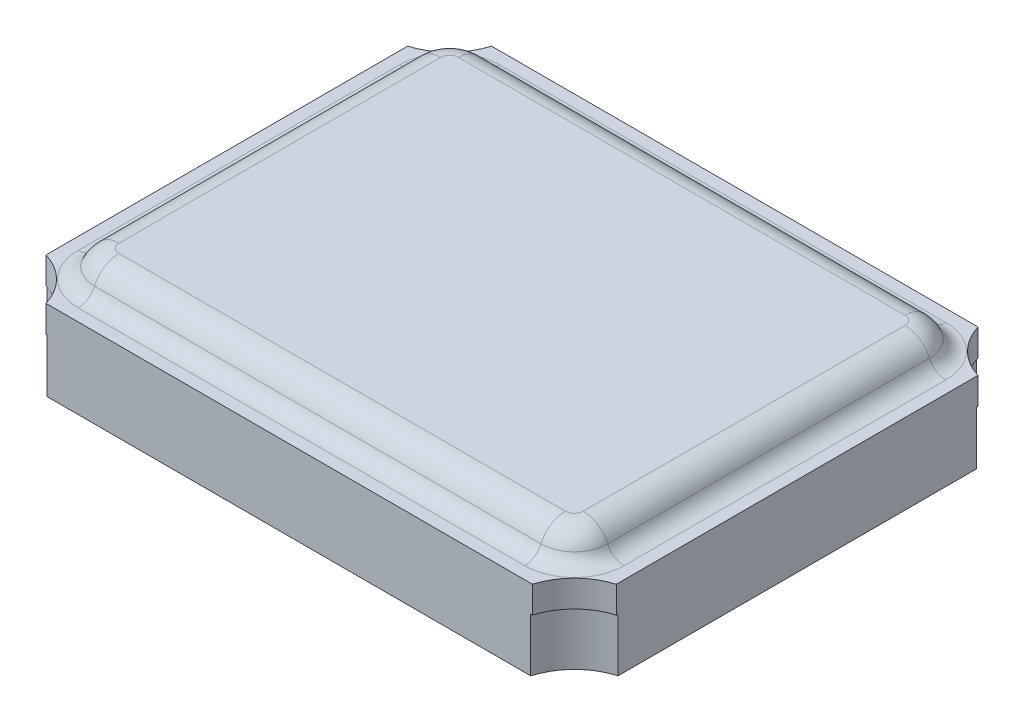
ISO-10303-21;
HEADER;
FILE_DESCRIPTION(('STEP AP214'),'2;1');
FILE_NAME('part.step','',(''),(''),'','','');
FILE_SCHEMA(('AUTOMOTIVE_DESIGN { 1 0 10303 214 1 1 1 1 }'));
ENDSEC;
DATA;
#1=APPLICATION_CONTEXT('core data for automotive mechanical design processes');
#2=APPLICATION_PROTOCOL_DEFINITION('international standard','automotive_design',2000,#1);
#3=PRODUCT_CONTEXT('',#1,'mechanical');
#4=PRODUCT('Part','Part','',(#3));
#5=PRODUCT_RELATED_PRODUCT_CATEGORY('part','',(#4));
#6=PRODUCT_DEFINITION_FORMATION('','',#4);
#7=PRODUCT_DEFINITION_CONTEXT('part definition',#1,'design');
#8=PRODUCT_DEFINITION('design','',#6,#7);
#9=PRODUCT_DEFINITION_SHAPE('','',#8);
#10=(LENGTH_UNIT() NAMED_UNIT(*) SI_UNIT(.MILLI.,.METRE.));
#11=(NAMED_UNIT(*) PLANE_ANGLE_UNIT() SI_UNIT($,.RADIAN.));
#12=(NAMED_UNIT(*) SI_UNIT($,.STERADIAN.) SOLID_ANGLE_UNIT());
#13=UNCERTAINTY_MEASURE_WITH_UNIT(LENGTH_MEASURE(1.E-05),#10,'distance_accuracy_value','');
#14=(GEOMETRIC_REPRESENTATION_CONTEXT(3) GLOBAL_UNCERTAINTY_ASSIGNED_CONTEXT((#13)) GLOBAL_UNIT_ASSIGNED_CONTEXT((#10,
#11,#12)) REPRESENTATION_CONTEXT('',''));
#15=CARTESIAN_POINT('',(0.,0.,0.));
#16=DIRECTION('',(0.,0.,1.));
#17=DIRECTION('',(1.,0.,0.));
#18=AXIS2_PLACEMENT_3D('',#15,#16,#17);
#19=CARTESIAN_POINT('',(1.59999998773912,0.6,1.24999999556222));
#20=DIRECTION('',(0.,1.,0.));
#21=DIRECTION('',(0.,0.,1.));
#22=AXIS2_PLACEMENT_3D('',#19,#20,#21);
#23=PLANE('',#22);
#24=DIRECTION('',(0.,0.,1.));
#25=VECTOR('',#24,1.);
#26=CARTESIAN_POINT('',(0.297487396266169,0.6,0.798743698800394));
#27=LINE('',#26,#25);
#28=CARTESIAN_POINT('',(0.297487396266175,0.600000000000001,2.1525125890859));
#29=VERTEX_POINT('',#28);
#30=CARTESIAN_POINT('',(0.297487396266174,0.599999999999997,0.347487402038613));
#31=VERTEX_POINT('',#30);
#32=EDGE_CURVE('E487',#29,#31,#27,.F.);
#33=ORIENTED_EDGE('',*,*,#32,.F.);
#34=CARTESIAN_POINT('',(0.347487396266163,0.600000000000001,2.15251258908591));
#35=DIRECTION('',(0.,1.,0.));
#36=DIRECTION('',(0.,0.,1.));
#37=AXIS2_PLACEMENT_3D('',#34,#35,#36);
#38=CIRCLE('',#37,0.0499999999999691);
#39=CARTESIAN_POINT('',(0.347487396266167,0.599999999999999,2.20251258908588));
#40=VERTEX_POINT('',#39);
#41=EDGE_CURVE('E20',#29,#40,#38,.T.);
#42=ORIENTED_EDGE('',*,*,#41,.T.);
#43=DIRECTION('',(1.,0.,0.));
#44=VECTOR('',#43,1.);
#45=CARTESIAN_POINT('',(0.973743692002642,0.6,2.20251258908588));
#46=LINE('',#45,#44);
#47=CARTESIAN_POINT('',(2.85251257921206,0.6,2.20251258908588));
#48=VERTEX_POINT('',#47);
#49=EDGE_CURVE('E426',#48,#40,#46,.F.);
#50=ORIENTED_EDGE('',*,*,#49,.F.);
#51=CARTESIAN_POINT('',(2.85251257921206,0.599999999999999,2.15251258908587));
#52=DIRECTION('',(0.,1.,0.));
#53=DIRECTION('',(0.,0.,1.));
#54=AXIS2_PLACEMENT_3D('',#51,#52,#53);
#55=CIRCLE('',#54,0.0499999999999989);
#56=CARTESIAN_POINT('',(2.90251257921206,0.599999999999999,2.15251258908587));
#57=VERTEX_POINT('',#56);
#58=EDGE_CURVE('E449',#48,#57,#55,.T.);
#59=ORIENTED_EDGE('',*,*,#58,.T.);
#60=DIRECTION('',(0.,0.,-1.));
#61=VECTOR('',#60,1.);
#62=CARTESIAN_POINT('',(2.90251257921206,0.6,1.70125629232405));
#63=LINE('',#62,#61);
#64=CARTESIAN_POINT('',(2.90251257921206,0.599999999999998,0.347487402038569));
#65=VERTEX_POINT('',#64);
#66=EDGE_CURVE('E459',#65,#57,#63,.F.);
#67=ORIENTED_EDGE('',*,*,#66,.F.);
#68=CARTESIAN_POINT('',(2.85251257921206,0.599999999999998,0.347487402038573));
#69=DIRECTION('',(0.,1.,0.));
#70=DIRECTION('',(0.,0.,1.));
#71=AXIS2_PLACEMENT_3D('',#68,#69,#70);
#72=CIRCLE('',#71,0.0500000000000093);
#73=CARTESIAN_POINT('',(2.85251257921206,0.6,0.297487402038566));
#74=VERTEX_POINT('',#73);
#75=EDGE_CURVE('E469',#65,#74,#72,.T.);
#76=ORIENTED_EDGE('',*,*,#75,.T.);
#77=DIRECTION('',(-1.,0.,0.));
#78=VECTOR('',#77,1.);
#79=CARTESIAN_POINT('',(2.22625628347559,0.6,0.297487402038565));
#80=LINE('',#79,#78);
#81=CARTESIAN_POINT('',(0.347487396266196,0.599999999999998,0.297487402038572));
#82=VERTEX_POINT('',#81);
#83=EDGE_CURVE('E478',#82,#74,#80,.F.);
#84=ORIENTED_EDGE('',*,*,#83,.F.);
#85=CARTESIAN_POINT('',(0.347487396266224,0.599999999999989,0.347487402038624));
#86=DIRECTION('',(1.70601822522482E-13,1.,1.86794537880544E-13));
#87=DIRECTION('',(0.,-1.86794537880544E-13,1.));
#88=AXIS2_PLACEMENT_3D('',#85,#86,#87);
#89=CIRCLE('',#88,0.0500000000000564);
#90=EDGE_CURVE('E483',#82,#31,#89,.T.);
#91=ORIENTED_EDGE('',*,*,#90,.T.);
#92=EDGE_LOOP('',(#33,#42,#50,#59,#67,#76,#84,#91));
#93=FACE_BOUND('',#92,.T.);
#94=ADVANCED_FACE('F16',(#93),#23,.T.);
#95=CARTESIAN_POINT('',(0.297487396266168,0.45,0.798743698800394));
#96=DIRECTION('',(0.,0.,1.));
#97=DIRECTION('',(1.,0.,0.));
#98=AXIS2_PLACEMENT_3D('',#95,#96,#97);
#99=CYLINDRICAL_SURFACE('',#98,0.15);
#100=ORIENTED_EDGE('',*,*,#32,.T.);
#101=CARTESIAN_POINT('',(0.297487396266165,0.449999999999997,0.347487402038575));
#102=DIRECTION('',(0.,-1.8913304564466E-13,1.));
#103=DIRECTION('',(0.,-1.,-1.8913304564466E-13));
#104=AXIS2_PLACEMENT_3D('',#101,#102,#103);
#105=CIRCLE('',#104,0.15);
#106=CARTESIAN_POINT('',(0.160010125417491,0.509999999999996,0.34748740203857));
#107=VERTEX_POINT('',#106);
#108=EDGE_CURVE('E479',#31,#107,#105,.T.);
#109=ORIENTED_EDGE('',*,*,#108,.T.);
#110=DIRECTION('',(0.,0.,-1.));
#111=VECTOR('',#110,1.);
#112=CARTESIAN_POINT('',(0.160010125417493,0.51,0.798743698800394));
#113=LINE('',#112,#111);
#114=CARTESIAN_POINT('',(0.160010125417493,0.51,2.15251258908588));
#115=VERTEX_POINT('',#114);
#116=EDGE_CURVE('E166',#107,#115,#113,.F.);
#117=ORIENTED_EDGE('',*,*,#116,.T.);
#118=CARTESIAN_POINT('',(0.297487396266169,0.45,2.15251258908589));
#119=DIRECTION('',(0.,0.,-1.));
#120=DIRECTION('',(0.,1.,0.));
#121=AXIS2_PLACEMENT_3D('',#118,#119,#120);
#122=CIRCLE('',#121,0.150000000000001);
#123=EDGE_CURVE('E423',#115,#29,#122,.T.);
#124=ORIENTED_EDGE('',*,*,#123,.T.);
#125=EDGE_LOOP('',(#100,#109,#117,#124));
#126=FACE_BOUND('',#125,.T.);
#127=ADVANCED_FACE('F831',(#126),#99,.T.);
#128=CARTESIAN_POINT('',(0.347487396266199,0.449999999999988,0.347487402038596));
#129=DIRECTION('',(1.70601822522482E-13,1.,1.86794537880544E-13));
#130=DIRECTION('',(0.,-1.86794537880544E-13,1.));
#131=AXIS2_PLACEMENT_3D('',#128,#129,#130);
#132=DEGENERATE_TOROIDAL_SURFACE('',#131,0.0500000000000337,0.150000000000001,.T.);
#133=ORIENTED_EDGE('',*,*,#108,.F.);
#134=ORIENTED_EDGE('',*,*,#90,.F.);
#135=CARTESIAN_POINT('',(0.347487396266168,0.45,0.297487402038564));
#136=DIRECTION('',(-1.,0.,0.));
#137=DIRECTION('',(0.,0.,1.));
#138=AXIS2_PLACEMENT_3D('',#135,#136,#137);
#139=CIRCLE('',#138,0.15);
#140=CARTESIAN_POINT('',(0.347487396266168,0.51,0.160010131189889));
#141=VERTEX_POINT('',#140);
#142=EDGE_CURVE('E475',#141,#82,#139,.F.);
#143=ORIENTED_EDGE('',*,*,#142,.F.);
#144=CARTESIAN_POINT('',(0.347487396266168,0.51,0.347487402038565));
#145=DIRECTION('',(0.,-1.,0.));
#146=DIRECTION('',(0.,0.,-1.));
#147=AXIS2_PLACEMENT_3D('',#144,#145,#146);
#148=CIRCLE('',#147,0.187477270848675);
#149=EDGE_CURVE('E174',#141,#107,#148,.F.);
#150=ORIENTED_EDGE('',*,*,#149,.T.);
#151=EDGE_LOOP('',(#133,#134,#143,#150));
#152=FACE_BOUND('',#151,.T.);
#153=ADVANCED_FACE('F535',(#152),#132,.T.);
#154=CARTESIAN_POINT('',(2.22625628347559,0.45,0.297487402038564));
#155=DIRECTION('',(-1.,0.,0.));
#156=DIRECTION('',(0.,0.,1.));
#157=AXIS2_PLACEMENT_3D('',#154,#155,#156);
#158=CYLINDRICAL_SURFACE('',#157,0.15);
#159=ORIENTED_EDGE('',*,*,#83,.T.);
#160=CARTESIAN_POINT('',(2.85251257921206,0.449999999999997,0.297487402038567));
#161=DIRECTION('',(-1.,0.,0.));
#162=DIRECTION('',(0.,-1.,0.));
#163=AXIS2_PLACEMENT_3D('',#160,#161,#162);
#164=CIRCLE('',#163,0.150000000000004);
#165=CARTESIAN_POINT('',(2.85251257921206,0.509999999999999,0.160010131189889));
#166=VERTEX_POINT('',#165);
#167=EDGE_CURVE('E460',#74,#166,#164,.T.);
#168=ORIENTED_EDGE('',*,*,#167,.T.);
#169=DIRECTION('',(1.,0.,0.));
#170=VECTOR('',#169,1.);
#171=CARTESIAN_POINT('',(2.22625628347559,0.51,0.160010131189889));
#172=LINE('',#171,#170);
#173=EDGE_CURVE('E390',#166,#141,#172,.F.);
#174=ORIENTED_EDGE('',*,*,#173,.T.);
#175=ORIENTED_EDGE('',*,*,#142,.T.);
#176=EDGE_LOOP('',(#159,#168,#174,#175));
#177=FACE_BOUND('',#176,.T.);
#178=ADVANCED_FACE('F538',(#177),#158,.T.);
#179=CARTESIAN_POINT('',(2.85251257921206,0.449999999999996,0.347487402038568));
#180=DIRECTION('',(0.,1.,0.));
#181=DIRECTION('',(0.,0.,1.));
#182=AXIS2_PLACEMENT_3D('',#179,#180,#181);
#183=DEGENERATE_TOROIDAL_SURFACE('',#182,0.0500000000000045,0.150000000000002,.T.);
#184=ORIENTED_EDGE('',*,*,#167,.F.);
#185=ORIENTED_EDGE('',*,*,#75,.F.);
#186=CARTESIAN_POINT('',(2.90251257921206,0.45,0.347487402038565));
#187=DIRECTION('',(0.,0.,-1.));
#188=DIRECTION('',(-1.,0.,0.));
#189=AXIS2_PLACEMENT_3D('',#186,#187,#188);
#190=CIRCLE('',#189,0.15);
#191=CARTESIAN_POINT('',(3.03998985006074,0.51,0.347487402038565));
#192=VERTEX_POINT('',#191);
#193=EDGE_CURVE('E456',#192,#65,#190,.F.);
#194=ORIENTED_EDGE('',*,*,#193,.F.);
#195=CARTESIAN_POINT('',(2.85251257921206,0.509999999999999,0.347487402038565));
#196=DIRECTION('',(0.,-1.,0.));
#197=DIRECTION('',(0.,0.,-1.));
#198=AXIS2_PLACEMENT_3D('',#195,#196,#197);
#199=CIRCLE('',#198,0.187477270848677);
#200=EDGE_CURVE('E385',#192,#166,#199,.F.);
#201=ORIENTED_EDGE('',*,*,#200,.T.);
#202=EDGE_LOOP('',(#184,#185,#194,#201));
#203=FACE_BOUND('',#202,.T.);
#204=ADVANCED_FACE('F611',(#203),#183,.T.);
#205=CARTESIAN_POINT('',(2.90251257921206,0.45,1.70125629232405));
#206=DIRECTION('',(0.,0.,-1.));
#207=DIRECTION('',(-1.,0.,0.));
#208=AXIS2_PLACEMENT_3D('',#205,#206,#207);
#209=CYLINDRICAL_SURFACE('',#208,0.15);
#210=ORIENTED_EDGE('',*,*,#66,.T.);
#211=CARTESIAN_POINT('',(2.90251257921206,0.449999999999998,2.15251258908587));
#212=DIRECTION('',(0.,0.,-1.));
#213=DIRECTION('',(-1.,0.,0.));
#214=AXIS2_PLACEMENT_3D('',#211,#212,#213);
#215=CIRCLE('',#214,0.150000000000001);
#216=CARTESIAN_POINT('',(3.03998985006074,0.509999999999998,2.15251258908588));
#217=VERTEX_POINT('',#216);
#218=EDGE_CURVE('E440',#57,#217,#215,.T.);
#219=ORIENTED_EDGE('',*,*,#218,.T.);
#220=DIRECTION('',(0.,0.,1.));
#221=VECTOR('',#220,1.);
#222=CARTESIAN_POINT('',(3.03998985006074,0.510000000000001,1.70125629232405));
#223=LINE('',#222,#221);
#224=EDGE_CURVE('E360',#217,#192,#223,.F.);
#225=ORIENTED_EDGE('',*,*,#224,.T.);
#226=ORIENTED_EDGE('',*,*,#193,.T.);
#227=EDGE_LOOP('',(#210,#219,#225,#226));
#228=FACE_BOUND('',#227,.T.);
#229=ADVANCED_FACE('F609',(#228),#209,.T.);
#230=CARTESIAN_POINT('',(2.85251257921206,0.45,2.15251258908587));
#231=DIRECTION('',(0.,1.,0.));
#232=DIRECTION('',(0.,0.,1.));
#233=AXIS2_PLACEMENT_3D('',#230,#231,#232);
#234=DEGENERATE_TOROIDAL_SURFACE('',#233,0.0500000000000153,0.149999999999999,.T.);
#235=ORIENTED_EDGE('',*,*,#218,.F.);
#236=ORIENTED_EDGE('',*,*,#58,.F.);
#237=CARTESIAN_POINT('',(2.85251257921206,0.45,2.20251258908588));
#238=DIRECTION('',(1.,0.,0.));
#239=DIRECTION('',(0.,0.,-1.));
#240=AXIS2_PLACEMENT_3D('',#237,#238,#239);
#241=CIRCLE('',#240,0.15);
#242=CARTESIAN_POINT('',(2.85251257921206,0.51,2.33998985993456));
#243=VERTEX_POINT('',#242);
#244=EDGE_CURVE('E437',#243,#48,#241,.F.);
#245=ORIENTED_EDGE('',*,*,#244,.F.);
#246=CARTESIAN_POINT('',(2.85251257921206,0.509999999999998,2.15251258908588));
#247=DIRECTION('',(0.,-1.,0.));
#248=DIRECTION('',(0.,0.,-1.));
#249=AXIS2_PLACEMENT_3D('',#246,#247,#248);
#250=CIRCLE('',#249,0.187477270848676);
#251=EDGE_CURVE('E354',#243,#217,#250,.F.);
#252=ORIENTED_EDGE('',*,*,#251,.T.);
#253=EDGE_LOOP('',(#235,#236,#245,#252));
#254=FACE_BOUND('',#253,.T.);
#255=ADVANCED_FACE('F604',(#254),#234,.T.);
#256=CARTESIAN_POINT('',(0.973743692002642,0.45,2.20251258908588));
#257=DIRECTION('',(1.,0.,0.));
#258=DIRECTION('',(0.,0.,-1.));
#259=AXIS2_PLACEMENT_3D('',#256,#257,#258);
#260=CYLINDRICAL_SURFACE('',#259,0.15);
#261=ORIENTED_EDGE('',*,*,#49,.T.);
#262=CARTESIAN_POINT('',(0.347487396266174,0.449999999999994,2.20251258908589));
#263=DIRECTION('',(1.,0.,0.));
#264=DIRECTION('',(0.,1.,0.));
#265=AXIS2_PLACEMENT_3D('',#262,#263,#264);
#266=CIRCLE('',#265,0.150000000000006);
#267=CARTESIAN_POINT('',(0.347487396266169,0.509999999999998,2.33998985993456));
#268=VERTEX_POINT('',#267);
#269=EDGE_CURVE('E413',#40,#268,#266,.T.);
#270=ORIENTED_EDGE('',*,*,#269,.T.);
#271=DIRECTION('',(-1.,0.,0.));
#272=VECTOR('',#271,1.);
#273=CARTESIAN_POINT('',(0.973743692002642,0.510000000000001,2.33998985993456));
#274=LINE('',#273,#272);
#275=EDGE_CURVE('E329',#268,#243,#274,.F.);
#276=ORIENTED_EDGE('',*,*,#275,.T.);
#277=ORIENTED_EDGE('',*,*,#244,.T.);
#278=EDGE_LOOP('',(#261,#270,#276,#277));
#279=FACE_BOUND('',#278,.T.);
#280=ADVANCED_FACE('F606',(#279),#260,.T.);
#281=CARTESIAN_POINT('',(0.347487396266163,0.45,2.1525125890859));
#282=DIRECTION('',(0.,1.,0.));
#283=DIRECTION('',(0.,0.,1.));
#284=AXIS2_PLACEMENT_3D('',#281,#282,#283);
#285=DEGENERATE_TOROIDAL_SURFACE('',#284,0.0499999999999942,0.150000000000001,.T.);
#286=ORIENTED_EDGE('',*,*,#269,.F.);
#287=ORIENTED_EDGE('',*,*,#41,.F.);
#288=ORIENTED_EDGE('',*,*,#123,.F.);
#289=CARTESIAN_POINT('',(0.347487396266168,0.51,2.15251258908588));
#290=DIRECTION('',(0.,-1.,0.));
#291=DIRECTION('',(0.,0.,-1.));
#292=AXIS2_PLACEMENT_3D('',#289,#290,#291);
#293=CIRCLE('',#292,0.187477270848675);
#294=EDGE_CURVE('E225',#115,#268,#293,.F.);
#295=ORIENTED_EDGE('',*,*,#294,.T.);
#296=EDGE_LOOP('',(#286,#287,#288,#295));
#297=FACE_BOUND('',#296,.T.);
#298=ADVANCED_FACE('F18',(#297),#285,.T.);
#299=CARTESIAN_POINT('',(0.0683586115183765,0.55,0.798743698800394));
#300=DIRECTION('',(0.,0.,-1.));
#301=DIRECTION('',(-1.,0.,0.));
#302=AXIS2_PLACEMENT_3D('',#299,#300,#301);
#303=CYLINDRICAL_SURFACE('',#302,0.1);
#304=ORIENTED_EDGE('',*,*,#116,.F.);
#305=CARTESIAN_POINT('',(0.0683586115183759,0.55,0.347487402038565));
#306=DIRECTION('',(0.,0.,-1.));
#307=DIRECTION('',(-1.,0.,0.));
#308=AXIS2_PLACEMENT_3D('',#305,#306,#307);
#309=CIRCLE('',#308,0.1);
#310=CARTESIAN_POINT('',(0.0683586115183763,0.45,0.347487402038565));
#311=VERTEX_POINT('',#310);
#312=EDGE_CURVE('E242',#107,#311,#309,.T.);
#313=ORIENTED_EDGE('',*,*,#312,.T.);
#314=DIRECTION('',(0.,0.,1.));
#315=VECTOR('',#314,1.);
#316=CARTESIAN_POINT('',(0.0683586115183766,0.45,1.25));
#317=LINE('',#316,#315);
#318=CARTESIAN_POINT('',(0.0683586115183743,0.45,2.15251258908588));
#319=VERTEX_POINT('',#318);
#320=EDGE_CURVE('E234',#319,#311,#317,.F.);
#321=ORIENTED_EDGE('',*,*,#320,.F.);
#322=CARTESIAN_POINT('',(0.068358611518376,0.55,2.15251258908588));
#323=DIRECTION('',(0.,0.,-1.));
#324=DIRECTION('',(-1.,0.,0.));
#325=AXIS2_PLACEMENT_3D('',#322,#323,#324);
#326=CIRCLE('',#325,0.1);
#327=EDGE_CURVE('E218',#319,#115,#326,.F.);
#328=ORIENTED_EDGE('',*,*,#327,.T.);
#329=EDGE_LOOP('',(#304,#313,#321,#328));
#330=FACE_BOUND('',#329,.T.);
#331=ADVANCED_FACE('F241',(#330),#303,.F.);
#332=CARTESIAN_POINT('',(0.347487396266168,0.55,0.347487402038565));
#333=DIRECTION('',(0.,-1.,0.));
#334=DIRECTION('',(0.,0.,-1.));
#335=AXIS2_PLACEMENT_3D('',#332,#333,#334);
#336=TOROIDAL_SURFACE('',#335,0.279128784747792,0.1);
#337=CARTESIAN_POINT('',(0.347487396266168,0.45,0.347487402038565));
#338=DIRECTION('',(0.,1.,0.));
#339=DIRECTION('',(0.,0.,-1.));
#340=AXIS2_PLACEMENT_3D('',#337,#338,#339);
#341=CIRCLE('',#340,0.279128784747792);
#342=CARTESIAN_POINT('',(0.347487396266168,0.45,0.0683586172907728));
#343=VERTEX_POINT('',#342);
#344=EDGE_CURVE('E244',#311,#343,#341,.F.);
#345=ORIENTED_EDGE('',*,*,#344,.F.);
#346=ORIENTED_EDGE('',*,*,#312,.F.);
#347=ORIENTED_EDGE('',*,*,#149,.F.);
#348=CARTESIAN_POINT('',(0.347487396266168,0.55,0.0683586172907727));
#349=DIRECTION('',(1.,0.,0.));
#350=DIRECTION('',(0.,0.,-1.));
#351=AXIS2_PLACEMENT_3D('',#348,#349,#350);
#352=CIRCLE('',#351,0.1);
#353=EDGE_CURVE('E388',#141,#343,#352,.T.);
#354=ORIENTED_EDGE('',*,*,#353,.T.);
#355=EDGE_LOOP('',(#345,#346,#347,#354));
#356=FACE_BOUND('',#355,.T.);
#357=ADVANCED_FACE('F396',(#356),#336,.F.);
#358=CARTESIAN_POINT('',(2.22625628347559,0.55,0.0683586172907723));
#359=DIRECTION('',(1.,0.,0.));
#360=DIRECTION('',(0.,0.,-1.));
#361=AXIS2_PLACEMENT_3D('',#358,#359,#360);
#362=CYLINDRICAL_SURFACE('',#361,0.1);
#363=DIRECTION('',(1.,0.,0.));
#364=VECTOR('',#363,1.);
#365=CARTESIAN_POINT('',(1.6,0.45,0.0683586172907727));
#366=LINE('',#365,#364);
#367=CARTESIAN_POINT('',(2.85251257921206,0.45,0.068358617290772));
#368=VERTEX_POINT('',#367);
#369=EDGE_CURVE('E247',#343,#368,#366,.T.);
#370=ORIENTED_EDGE('',*,*,#369,.F.);
#371=ORIENTED_EDGE('',*,*,#353,.F.);
#372=ORIENTED_EDGE('',*,*,#173,.F.);
#373=CARTESIAN_POINT('',(2.85251257921206,0.55,0.068358617290772));
#374=DIRECTION('',(1.,0.,0.));
#375=DIRECTION('',(0.,0.,-1.));
#376=AXIS2_PLACEMENT_3D('',#373,#374,#375);
#377=CIRCLE('',#376,0.1);
#378=EDGE_CURVE('E377',#166,#368,#377,.T.);
#379=ORIENTED_EDGE('',*,*,#378,.T.);
#380=EDGE_LOOP('',(#370,#371,#372,#379));
#381=FACE_BOUND('',#380,.T.);
#382=ADVANCED_FACE('F371',(#381),#362,.F.);
#383=CARTESIAN_POINT('',(2.85251257921206,0.55,0.347487402038565));
#384=DIRECTION('',(0.,-1.,0.));
#385=DIRECTION('',(0.,0.,-1.));
#386=AXIS2_PLACEMENT_3D('',#383,#384,#385);
#387=TOROIDAL_SURFACE('',#386,0.279128784747793,0.1);
#388=CARTESIAN_POINT('',(2.85251257921206,0.45,0.347487402038565));
#389=DIRECTION('',(0.,1.,0.));
#390=DIRECTION('',(1.,0.,0.));
#391=AXIS2_PLACEMENT_3D('',#388,#389,#390);
#392=CIRCLE('',#391,0.279128784747793);
#393=CARTESIAN_POINT('',(3.13164136395986,0.45,0.347487402038565));
#394=VERTEX_POINT('',#393);
#395=EDGE_CURVE('E597',#368,#394,#392,.F.);
#396=ORIENTED_EDGE('',*,*,#395,.F.);
#397=ORIENTED_EDGE('',*,*,#378,.F.);
#398=ORIENTED_EDGE('',*,*,#200,.F.);
#399=CARTESIAN_POINT('',(3.13164136395986,0.55,0.347487402038565));
#400=DIRECTION('',(0.,0.,1.));
#401=DIRECTION('',(1.,0.,0.));
#402=AXIS2_PLACEMENT_3D('',#399,#400,#401);
#403=CIRCLE('',#402,0.1);
#404=EDGE_CURVE('E357',#192,#394,#403,.T.);
#405=ORIENTED_EDGE('',*,*,#404,.T.);
#406=EDGE_LOOP('',(#396,#397,#398,#405));
#407=FACE_BOUND('',#406,.T.);
#408=ADVANCED_FACE('F367',(#407),#387,.F.);
#409=CARTESIAN_POINT('',(3.13164136395986,0.55,1.70125629232405));
#410=DIRECTION('',(0.,0.,1.));
#411=DIRECTION('',(1.,0.,0.));
#412=AXIS2_PLACEMENT_3D('',#409,#410,#411);
#413=CYLINDRICAL_SURFACE('',#412,0.1);
#414=DIRECTION('',(0.,0.,1.));
#415=VECTOR('',#414,1.);
#416=CARTESIAN_POINT('',(3.13164136395986,0.45,1.25));
#417=LINE('',#416,#415);
#418=CARTESIAN_POINT('',(3.13164136395986,0.45,2.15251258908588));
#419=VERTEX_POINT('',#418);
#420=EDGE_CURVE('E588',#394,#419,#417,.T.);
#421=ORIENTED_EDGE('',*,*,#420,.F.);
#422=ORIENTED_EDGE('',*,*,#404,.F.);
#423=ORIENTED_EDGE('',*,*,#224,.F.);
#424=CARTESIAN_POINT('',(3.13164136395985,0.55,2.15251258908588));
#425=DIRECTION('',(0.,0.,1.));
#426=DIRECTION('',(1.,0.,0.));
#427=AXIS2_PLACEMENT_3D('',#424,#425,#426);
#428=CIRCLE('',#427,0.1);
#429=EDGE_CURVE('E346',#217,#419,#428,.T.);
#430=ORIENTED_EDGE('',*,*,#429,.T.);
#431=EDGE_LOOP('',(#421,#422,#423,#430));
#432=FACE_BOUND('',#431,.T.);
#433=ADVANCED_FACE('F340',(#432),#413,.F.);
#434=CARTESIAN_POINT('',(2.85251257921206,0.55,2.15251258908588));
#435=DIRECTION('',(0.,-1.,0.));
#436=DIRECTION('',(0.,0.,-1.));
#437=AXIS2_PLACEMENT_3D('',#434,#435,#436);
#438=TOROIDAL_SURFACE('',#437,0.279128784747792,0.1);
#439=CARTESIAN_POINT('',(2.85251257921206,0.45,2.15251258908588));
#440=DIRECTION('',(0.,1.,0.));
#441=DIRECTION('',(0.,0.,1.));
#442=AXIS2_PLACEMENT_3D('',#439,#440,#441);
#443=CIRCLE('',#442,0.279128784747796);
#444=CARTESIAN_POINT('',(2.85251257921206,0.45,2.43164137383368));
#445=VERTEX_POINT('',#444);
#446=EDGE_CURVE('E579',#419,#445,#443,.F.);
#447=ORIENTED_EDGE('',*,*,#446,.F.);
#448=ORIENTED_EDGE('',*,*,#429,.F.);
#449=ORIENTED_EDGE('',*,*,#251,.F.);
#450=CARTESIAN_POINT('',(2.85251257921206,0.55,2.43164137383368));
#451=DIRECTION('',(-1.,0.,0.));
#452=DIRECTION('',(0.,0.,1.));
#453=AXIS2_PLACEMENT_3D('',#450,#451,#452);
#454=CIRCLE('',#453,0.1);
#455=EDGE_CURVE('E326',#243,#445,#454,.T.);
#456=ORIENTED_EDGE('',*,*,#455,.T.);
#457=EDGE_LOOP('',(#447,#448,#449,#456));
#458=FACE_BOUND('',#457,.T.);
#459=ADVANCED_FACE('F336',(#458),#438,.F.);
#460=CARTESIAN_POINT('',(0.973743692002642,0.55,2.43164137383368));
#461=DIRECTION('',(-1.,0.,0.));
#462=DIRECTION('',(0.,0.,1.));
#463=AXIS2_PLACEMENT_3D('',#460,#461,#462);
#464=CYLINDRICAL_SURFACE('',#463,0.1);
#465=DIRECTION('',(1.,0.,0.));
#466=VECTOR('',#465,1.);
#467=CARTESIAN_POINT('',(1.6,0.45,2.43164137383368));
#468=LINE('',#467,#466);
#469=CARTESIAN_POINT('',(0.347487396266168,0.45,2.43164137383368));
#470=VERTEX_POINT('',#469);
#471=EDGE_CURVE('E236',#445,#470,#468,.F.);
#472=ORIENTED_EDGE('',*,*,#471,.F.);
#473=ORIENTED_EDGE('',*,*,#455,.F.);
#474=ORIENTED_EDGE('',*,*,#275,.F.);
#475=CARTESIAN_POINT('',(0.347487396266168,0.55,2.43164137383367));
#476=DIRECTION('',(-1.,0.,0.));
#477=DIRECTION('',(0.,0.,1.));
#478=AXIS2_PLACEMENT_3D('',#475,#476,#477);
#479=CIRCLE('',#478,0.1);
#480=EDGE_CURVE('E228',#268,#470,#479,.T.);
#481=ORIENTED_EDGE('',*,*,#480,.T.);
#482=EDGE_LOOP('',(#472,#473,#474,#481));
#483=FACE_BOUND('',#482,.T.);
#484=ADVANCED_FACE('F310',(#483),#464,.F.);
#485=CARTESIAN_POINT('',(0.347487396266168,0.55,2.15251258908588));
#486=DIRECTION('',(0.,-1.,0.));
#487=DIRECTION('',(0.,0.,-1.));
#488=AXIS2_PLACEMENT_3D('',#485,#486,#487);
#489=TOROIDAL_SURFACE('',#488,0.279128784747792,0.1);
#490=CARTESIAN_POINT('',(0.347487396266168,0.45,2.15251258908588));
#491=DIRECTION('',(0.,1.,0.));
#492=DIRECTION('',(-1.,0.,0.));
#493=AXIS2_PLACEMENT_3D('',#490,#491,#492);
#494=CIRCLE('',#493,0.279128784747796);
#495=EDGE_CURVE('E222',#470,#319,#494,.F.);
#496=ORIENTED_EDGE('',*,*,#495,.F.);
#497=ORIENTED_EDGE('',*,*,#480,.F.);
#498=ORIENTED_EDGE('',*,*,#294,.F.);
#499=ORIENTED_EDGE('',*,*,#327,.F.);
#500=EDGE_LOOP('',(#496,#497,#498,#499));
#501=FACE_BOUND('',#500,.T.);
#502=ADVANCED_FACE('F220',(#501),#489,.F.);
#503=CARTESIAN_POINT('',(-0.0999999977648258,0.45,2.59999994188547));
#504=DIRECTION('',(0.,-1.,0.));
#505=DIRECTION('',(0.,0.,-1.));
#506=AXIS2_PLACEMENT_3D('',#503,#504,#505);
#507=CYLINDRICAL_SURFACE('',#506,0.35);
#508=DIRECTION('',(0.,1.,0.));
#509=VECTOR('',#508,1.);
#510=CARTESIAN_POINT('',(0.235410216186542,0.,2.5));
#511=LINE('',#510,#509);
#512=CARTESIAN_POINT('',(0.235410216186542,0.45,2.5));
#513=VERTEX_POINT('',#512);
#514=CARTESIAN_POINT('',(0.235410216186542,0.3,2.5));
#515=VERTEX_POINT('',#514);
#516=EDGE_CURVE('E283',#513,#515,#511,.F.);
#517=ORIENTED_EDGE('',*,*,#516,.F.);
#518=CARTESIAN_POINT('',(-0.0999999977648258,0.45,2.59999994188547));
#519=DIRECTION('',(0.,-1.,0.));
#520=DIRECTION('',(0.,0.,-1.));
#521=AXIS2_PLACEMENT_3D('',#518,#519,#520);
#522=CIRCLE('',#521,0.35);
#523=CARTESIAN_POINT('',(0.,0.45,2.2645897445941));
#524=VERTEX_POINT('',#523);
#525=EDGE_CURVE('E248',#524,#513,#522,.T.);
#526=ORIENTED_EDGE('',*,*,#525,.F.);
#527=DIRECTION('',(0.,1.,0.));
#528=VECTOR('',#527,1.);
#529=CARTESIAN_POINT('',(0.,0.,2.2645897445941));
#530=LINE('',#529,#528);
#531=CARTESIAN_POINT('',(0.,0.3,2.2645897445941));
#532=VERTEX_POINT('',#531);
#533=EDGE_CURVE('E292',#532,#524,#530,.T.);
#534=ORIENTED_EDGE('',*,*,#533,.F.);
#535=CARTESIAN_POINT('',(-0.0999999977648258,0.3,2.59999994188547));
#536=DIRECTION('',(0.,-1.,0.));
#537=DIRECTION('',(0.,0.,-1.));
#538=AXIS2_PLACEMENT_3D('',#535,#536,#537);
#539=CIRCLE('',#538,0.35);
#540=EDGE_CURVE('E227',#515,#532,#539,.F.);
#541=ORIENTED_EDGE('',*,*,#540,.F.);
#542=EDGE_LOOP('',(#517,#526,#534,#541));
#543=FACE_BOUND('',#542,.T.);
#544=ADVANCED_FACE('F309',(#543),#507,.F.);
#545=CARTESIAN_POINT('',(0.119999948975004,0.3,2.38000012972764));
#546=DIRECTION('',(0.,-1.,0.));
#547=DIRECTION('',(0.,0.,-1.));
#548=AXIS2_PLACEMENT_3D('',#545,#546,#547);
#549=PLANE('',#548);
#550=DIRECTION('',(1.,0.,0.));
#551=VECTOR('',#550,1.);
#552=CARTESIAN_POINT('',(0.,0.3,2.5));
#553=LINE('',#552,#551);
#554=CARTESIAN_POINT('',(0.239999853558162,0.3,2.5));
#555=VERTEX_POINT('',#554);
#556=EDGE_CURVE('E280',#515,#555,#553,.T.);
#557=ORIENTED_EDGE('',*,*,#556,.F.);
#558=ORIENTED_EDGE('',*,*,#540,.T.);
#559=DIRECTION('',(0.,0.,1.));
#560=VECTOR('',#559,1.);
#561=CARTESIAN_POINT('',(0.,0.3,0.));
#562=LINE('',#561,#560);
#563=CARTESIAN_POINT('',(0.,0.3,2.26000010734424));
#564=VERTEX_POINT('',#563);
#565=EDGE_CURVE('E289',#564,#532,#562,.T.);
#566=ORIENTED_EDGE('',*,*,#565,.F.);
#567=CARTESIAN_POINT('',(-0.0999999977648258,0.3,2.59999994188547));
#568=DIRECTION('',(0.,1.,0.));
#569=DIRECTION('',(0.,0.,1.));
#570=AXIS2_PLACEMENT_3D('',#567,#568,#569);
#571=CIRCLE('',#570,0.354400743567264);
#572=EDGE_CURVE('E279',#564,#555,#571,.F.);
#573=ORIENTED_EDGE('',*,*,#572,.T.);
#574=EDGE_LOOP('',(#557,#558,#566,#573));
#575=FACE_BOUND('',#574,.T.);
#576=ADVANCED_FACE('F738',(#575),#549,.T.);
#577=CARTESIAN_POINT('',(3.29999992623925,0.45,2.59999994188547));
#578=DIRECTION('',(0.,-1.,0.));
#579=DIRECTION('',(0.,0.,-1.));
#580=AXIS2_PLACEMENT_3D('',#577,#578,#579);
#581=CYLINDRICAL_SURFACE('',#580,0.35);
#582=DIRECTION('',(0.,1.,0.));
#583=VECTOR('',#582,1.);
#584=CARTESIAN_POINT('',(3.2,0.,2.26458972326931));
#585=LINE('',#584,#583);
#586=CARTESIAN_POINT('',(3.2,0.45,2.26458972326931));
#587=VERTEX_POINT('',#586);
#588=CARTESIAN_POINT('',(3.2,0.3,2.26458972326931));
#589=VERTEX_POINT('',#588);
#590=EDGE_CURVE('E268',#587,#589,#585,.F.);
#591=ORIENTED_EDGE('',*,*,#590,.F.);
#592=CARTESIAN_POINT('',(3.29999992623925,0.45,2.59999994188547));
#593=DIRECTION('',(0.,-1.,0.));
#594=DIRECTION('',(0.,0.,-1.));
#595=AXIS2_PLACEMENT_3D('',#592,#593,#594);
#596=CIRCLE('',#595,0.35);
#597=CARTESIAN_POINT('',(2.96458971228788,0.45,2.5));
#598=VERTEX_POINT('',#597);
#599=EDGE_CURVE('E245',#598,#587,#596,.T.);
#600=ORIENTED_EDGE('',*,*,#599,.F.);
#601=DIRECTION('',(0.,1.,0.));
#602=VECTOR('',#601,1.);
#603=CARTESIAN_POINT('',(2.96458971228788,0.,2.5));
#604=LINE('',#603,#602);
#605=CARTESIAN_POINT('',(2.96458971228788,0.3,2.5));
#606=VERTEX_POINT('',#605);
#607=EDGE_CURVE('E278',#606,#598,#604,.T.);
#608=ORIENTED_EDGE('',*,*,#607,.F.);
#609=CARTESIAN_POINT('',(3.29999992623925,0.3,2.59999994188547));
#610=DIRECTION('',(0.,-1.,0.));
#611=DIRECTION('',(0.,0.,-1.));
#612=AXIS2_PLACEMENT_3D('',#609,#610,#611);
#613=CIRCLE('',#612,0.35);
#614=EDGE_CURVE('E525',#589,#606,#613,.F.);
#615=ORIENTED_EDGE('',*,*,#614,.F.);
#616=EDGE_LOOP('',(#591,#600,#608,#615));
#617=FACE_BOUND('',#616,.T.);
#618=ADVANCED_FACE('F728',(#617),#581,.F.);
#619=CARTESIAN_POINT('',(3.077576677915,0.3,2.37757668380933));
#620=DIRECTION('',(0.,-1.,0.));
#621=DIRECTION('',(0.,0.,-1.));
#622=AXIS2_PLACEMENT_3D('',#619,#620,#621);
#623=PLANE('',#622);
#624=DIRECTION('',(0.,0.,-1.));
#625=VECTOR('',#624,1.);
#626=CARTESIAN_POINT('',(3.2,0.3,2.5));
#627=LINE('',#626,#625);
#628=CARTESIAN_POINT('',(3.2,0.3,2.25515336709183));
#629=VERTEX_POINT('',#628);
#630=EDGE_CURVE('E265',#589,#629,#627,.T.);
#631=ORIENTED_EDGE('',*,*,#630,.F.);
#632=ORIENTED_EDGE('',*,*,#614,.T.);
#633=DIRECTION('',(1.,0.,0.));
#634=VECTOR('',#633,1.);
#635=CARTESIAN_POINT('',(0.,0.3,2.5));
#636=LINE('',#635,#634);
#637=CARTESIAN_POINT('',(2.95515335590638,0.3,2.50000000026341));
#638=VERTEX_POINT('',#637);
#639=EDGE_CURVE('E275',#638,#606,#636,.T.);
#640=ORIENTED_EDGE('',*,*,#639,.F.);
#641=CARTESIAN_POINT('',(3.29999992623925,0.3,2.59999994188547));
#642=DIRECTION('',(0.,1.,0.));
#643=DIRECTION('',(0.,0.,1.));
#644=AXIS2_PLACEMENT_3D('',#641,#642,#643);
#645=CIRCLE('',#644,0.359053123360262);
#646=EDGE_CURVE('E264',#638,#629,#645,.F.);
#647=ORIENTED_EDGE('',*,*,#646,.T.);
#648=EDGE_LOOP('',(#631,#632,#640,#647));
#649=FACE_BOUND('',#648,.T.);
#650=ADVANCED_FACE('F732',(#649),#623,.T.);
#651=CARTESIAN_POINT('',(-0.0999999977648258,0.45,-0.0999999977648258));
#652=DIRECTION('',(0.,-1.,0.));
#653=DIRECTION('',(0.,0.,-1.));
#654=AXIS2_PLACEMENT_3D('',#651,#652,#653);
#655=CYLINDRICAL_SURFACE('',#654,0.35);
#656=DIRECTION('',(0.,1.,0.));
#657=VECTOR('',#656,1.);
#658=CARTESIAN_POINT('',(0.,0.,0.235410199526543));
#659=LINE('',#658,#657);
#660=CARTESIAN_POINT('',(0.,0.45,0.235410199526543));
#661=VERTEX_POINT('',#660);
#662=CARTESIAN_POINT('',(0.,0.3,0.235410199526543));
#663=VERTEX_POINT('',#662);
#664=EDGE_CURVE('E298',#661,#663,#659,.F.);
#665=ORIENTED_EDGE('',*,*,#664,.F.);
#666=CARTESIAN_POINT('',(-0.0999999977648258,0.45,-0.0999999977648258));
#667=DIRECTION('',(0.,-1.,0.));
#668=DIRECTION('',(0.,0.,-1.));
#669=AXIS2_PLACEMENT_3D('',#666,#667,#668);
#670=CIRCLE('',#669,0.35);
#671=CARTESIAN_POINT('',(0.235410199526543,0.45,0.));
#672=VERTEX_POINT('',#671);
#673=EDGE_CURVE('E523',#672,#661,#670,.T.);
#674=ORIENTED_EDGE('',*,*,#673,.F.);
#675=DIRECTION('',(0.,1.,0.));
#676=VECTOR('',#675,1.);
#677=CARTESIAN_POINT('',(0.235410199526543,0.,0.));
#678=LINE('',#677,#676);
#679=CARTESIAN_POINT('',(0.235410199526543,0.3,0.));
#680=VERTEX_POINT('',#679);
#681=EDGE_CURVE('E256',#680,#672,#678,.T.);
#682=ORIENTED_EDGE('',*,*,#681,.F.);
#683=CARTESIAN_POINT('',(-0.0999999977648258,0.3,-0.0999999977648258));
#684=DIRECTION('',(0.,-1.,0.));
#685=DIRECTION('',(0.,0.,-1.));
#686=AXIS2_PLACEMENT_3D('',#683,#684,#685);
#687=CIRCLE('',#686,0.35);
#688=EDGE_CURVE('E516',#663,#680,#687,.F.);
#689=ORIENTED_EDGE('',*,*,#688,.F.);
#690=EDGE_LOOP('',(#665,#674,#682,#689));
#691=FACE_BOUND('',#690,.T.);
#692=ADVANCED_FACE('F562',(#691),#655,.F.);
#693=CARTESIAN_POINT('',(1.6,0.45,1.25));
#694=DIRECTION('',(0.,1.,0.));
#695=DIRECTION('',(0.,0.,1.));
#696=AXIS2_PLACEMENT_3D('',#693,#694,#695);
#697=PLANE('',#696);
#698=ORIENTED_EDGE('',*,*,#471,.T.);
#699=ORIENTED_EDGE('',*,*,#495,.T.);
#700=ORIENTED_EDGE('',*,*,#320,.T.);
#701=ORIENTED_EDGE('',*,*,#344,.T.);
#702=ORIENTED_EDGE('',*,*,#369,.T.);
#703=ORIENTED_EDGE('',*,*,#395,.T.);
#704=ORIENTED_EDGE('',*,*,#420,.T.);
#705=ORIENTED_EDGE('',*,*,#446,.T.);
#706=EDGE_LOOP('',(#698,#699,#700,#701,#702,#703,#704,#705));
#707=FACE_BOUND('',#706,.T.);
#708=CARTESIAN_POINT('',(3.29999992623925,0.45,-0.0999999977648258));
#709=DIRECTION('',(0.,-1.,0.));
#710=DIRECTION('',(0.,0.,-1.));
#711=AXIS2_PLACEMENT_3D('',#708,#709,#710);
#712=CIRCLE('',#711,0.35);
#713=CARTESIAN_POINT('',(3.2,0.45,0.23541022085134));
#714=VERTEX_POINT('',#713);
#715=CARTESIAN_POINT('',(2.96458972894788,0.45,0.));
#716=VERTEX_POINT('',#715);
#717=EDGE_CURVE('E238',#714,#716,#712,.T.);
#718=ORIENTED_EDGE('',*,*,#717,.T.);
#719=DIRECTION('',(-1.,0.,0.));
#720=VECTOR('',#719,1.);
#721=CARTESIAN_POINT('',(3.2,0.45,0.));
#722=LINE('',#721,#720);
#723=EDGE_CURVE('E258',#672,#716,#722,.F.);
#724=ORIENTED_EDGE('',*,*,#723,.F.);
#725=ORIENTED_EDGE('',*,*,#673,.T.);
#726=DIRECTION('',(0.,0.,1.));
#727=VECTOR('',#726,1.);
#728=CARTESIAN_POINT('',(0.,0.45,0.));
#729=LINE('',#728,#727);
#730=EDGE_CURVE('E295',#524,#661,#729,.F.);
#731=ORIENTED_EDGE('',*,*,#730,.F.);
#732=ORIENTED_EDGE('',*,*,#525,.T.);
#733=DIRECTION('',(1.,0.,0.));
#734=VECTOR('',#733,1.);
#735=CARTESIAN_POINT('',(0.,0.45,2.5));
#736=LINE('',#735,#734);
#737=EDGE_CURVE('E285',#598,#513,#736,.F.);
#738=ORIENTED_EDGE('',*,*,#737,.F.);
#739=ORIENTED_EDGE('',*,*,#599,.T.);
#740=DIRECTION('',(0.,0.,-1.));
#741=VECTOR('',#740,1.);
#742=CARTESIAN_POINT('',(3.2,0.45,2.5));
#743=LINE('',#742,#741);
#744=EDGE_CURVE('E270',#714,#587,#743,.F.);
#745=ORIENTED_EDGE('',*,*,#744,.F.);
#746=EDGE_LOOP('',(#718,#724,#725,#731,#732,#738,#739,#745));
#747=FACE_BOUND('',#746,.T.);
#748=ADVANCED_FACE('F232',(#707,#747),#697,.T.);
#749=CARTESIAN_POINT('',(3.29999992623925,0.45,-0.0999999977648258));
#750=DIRECTION('',(0.,-1.,0.));
#751=DIRECTION('',(0.,0.,-1.));
#752=AXIS2_PLACEMENT_3D('',#749,#750,#751);
#753=CYLINDRICAL_SURFACE('',#752,0.35);
#754=DIRECTION('',(0.,1.,0.));
#755=VECTOR('',#754,1.);
#756=CARTESIAN_POINT('',(2.96458972894788,0.,0.));
#757=LINE('',#756,#755);
#758=CARTESIAN_POINT('',(2.96458972894788,0.3,0.));
#759=VERTEX_POINT('',#758);
#760=EDGE_CURVE('E677',#716,#759,#757,.F.);
#761=ORIENTED_EDGE('',*,*,#760,.F.);
#762=ORIENTED_EDGE('',*,*,#717,.F.);
#763=DIRECTION('',(0.,1.,0.));
#764=VECTOR('',#763,1.);
#765=CARTESIAN_POINT('',(3.2,0.,0.23541022085134));
#766=LINE('',#765,#764);
#767=CARTESIAN_POINT('',(3.2,0.3,0.23541022085134));
#768=VERTEX_POINT('',#767);
#769=EDGE_CURVE('E263',#768,#714,#766,.T.);
#770=ORIENTED_EDGE('',*,*,#769,.F.);
#771=CARTESIAN_POINT('',(3.29999992623925,0.3,-0.0999999977648258));
#772=DIRECTION('',(0.,-1.,0.));
#773=DIRECTION('',(0.,0.,-1.));
#774=AXIS2_PLACEMENT_3D('',#771,#772,#773);
#775=CIRCLE('',#774,0.35);
#776=EDGE_CURVE('E518',#759,#768,#775,.F.);
#777=ORIENTED_EDGE('',*,*,#776,.F.);
#778=EDGE_LOOP('',(#761,#762,#770,#777));
#779=FACE_BOUND('',#778,.T.);
#780=ADVANCED_FACE('F561',(#779),#753,.F.);
#781=CARTESIAN_POINT('',(3.07830819981706,0.3,0.121691774834973));
#782=DIRECTION('',(0.,-1.,0.));
#783=DIRECTION('',(0.,0.,-1.));
#784=AXIS2_PLACEMENT_3D('',#781,#782,#783);
#785=PLANE('',#784);
#786=DIRECTION('',(-1.,0.,0.));
#787=VECTOR('',#786,1.);
#788=CARTESIAN_POINT('',(3.2,0.3,0.));
#789=LINE('',#788,#787);
#790=CARTESIAN_POINT('',(2.95661639963412,0.3,0.));
#791=VERTEX_POINT('',#790);
#792=EDGE_CURVE('E672',#759,#791,#789,.T.);
#793=ORIENTED_EDGE('',*,*,#792,.F.);
#794=ORIENTED_EDGE('',*,*,#776,.T.);
#795=DIRECTION('',(0.,0.,-1.));
#796=VECTOR('',#795,1.);
#797=CARTESIAN_POINT('',(3.2,0.3,2.5));
#798=LINE('',#797,#796);
#799=CARTESIAN_POINT('',(3.2,0.3,0.243383549669946));
#800=VERTEX_POINT('',#799);
#801=EDGE_CURVE('E260',#800,#768,#798,.T.);
#802=ORIENTED_EDGE('',*,*,#801,.F.);
#803=CARTESIAN_POINT('',(3.29999992623925,0.3,-0.0999999977648276));
#804=DIRECTION('',(0.,1.,0.));
#805=DIRECTION('',(0.,0.,1.));
#806=AXIS2_PLACEMENT_3D('',#803,#804,#805);
#807=CIRCLE('',#806,0.357648215285278);
#808=EDGE_CURVE('E507',#800,#791,#807,.F.);
#809=ORIENTED_EDGE('',*,*,#808,.T.);
#810=EDGE_LOOP('',(#793,#794,#802,#809));
#811=FACE_BOUND('',#810,.T.);
#812=ADVANCED_FACE('F663',(#811),#785,.T.);
#813=CARTESIAN_POINT('',(0.122725356632208,0.3,0.122725356632208));
#814=DIRECTION('',(0.,-1.,0.));
#815=DIRECTION('',(0.,0.,-1.));
#816=AXIS2_PLACEMENT_3D('',#813,#814,#815);
#817=PLANE('',#816);
#818=DIRECTION('',(0.,0.,1.));
#819=VECTOR('',#818,1.);
#820=CARTESIAN_POINT('',(0.,0.3,0.));
#821=LINE('',#820,#819);
#822=CARTESIAN_POINT('',(0.,0.3,0.245450713264415));
#823=VERTEX_POINT('',#822);
#824=EDGE_CURVE('E293',#663,#823,#821,.T.);
#825=ORIENTED_EDGE('',*,*,#824,.F.);
#826=ORIENTED_EDGE('',*,*,#688,.T.);
#827=DIRECTION('',(-1.,0.,0.));
#828=VECTOR('',#827,1.);
#829=CARTESIAN_POINT('',(3.2,0.3,0.));
#830=LINE('',#829,#828);
#831=CARTESIAN_POINT('',(0.245450713264416,0.3,0.));
#832=VERTEX_POINT('',#831);
#833=EDGE_CURVE('E259',#832,#680,#830,.T.);
#834=ORIENTED_EDGE('',*,*,#833,.F.);
#835=CARTESIAN_POINT('',(-0.0999999977648258,0.3,-0.0999999977648258));
#836=DIRECTION('',(0.,1.,0.));
#837=DIRECTION('',(0.,0.,1.));
#838=AXIS2_PLACEMENT_3D('',#835,#836,#837);
#839=CIRCLE('',#838,0.359633415165462);
#840=EDGE_CURVE('E503',#832,#823,#839,.F.);
#841=ORIENTED_EDGE('',*,*,#840,.T.);
#842=EDGE_LOOP('',(#825,#826,#834,#841));
#843=FACE_BOUND('',#842,.T.);
#844=ADVANCED_FACE('F660',(#843),#817,.T.);
#845=CARTESIAN_POINT('',(0.,0.,0.));
#846=DIRECTION('',(-1.,0.,0.));
#847=DIRECTION('',(0.,0.,1.));
#848=AXIS2_PLACEMENT_3D('',#845,#846,#847);
#849=PLANE('',#848);
#850=ORIENTED_EDGE('',*,*,#730,.T.);
#851=ORIENTED_EDGE('',*,*,#664,.T.);
#852=ORIENTED_EDGE('',*,*,#824,.T.);
#853=DIRECTION('',(0.,1.,0.));
#854=VECTOR('',#853,1.);
#855=CARTESIAN_POINT('',(0.,0.,0.245450713264415));
#856=LINE('',#855,#854);
#857=CARTESIAN_POINT('',(0.,0.,0.245450713264415));
#858=VERTEX_POINT('',#857);
#859=EDGE_CURVE('E506',#823,#858,#856,.F.);
#860=ORIENTED_EDGE('',*,*,#859,.T.);
#861=DIRECTION('',(0.,0.,1.));
#862=VECTOR('',#861,1.);
#863=CARTESIAN_POINT('',(0.,0.,1.25));
#864=LINE('',#863,#862);
#865=CARTESIAN_POINT('',(0.,0.,2.26000010734424));
#866=VERTEX_POINT('',#865);
#867=EDGE_CURVE('E502',#858,#866,#864,.T.);
#868=ORIENTED_EDGE('',*,*,#867,.T.);
#869=DIRECTION('',(0.,1.,0.));
#870=VECTOR('',#869,1.);
#871=CARTESIAN_POINT('',(0.,0.,2.26000010734424));
#872=LINE('',#871,#870);
#873=EDGE_CURVE('E301',#866,#564,#872,.T.);
#874=ORIENTED_EDGE('',*,*,#873,.T.);
#875=ORIENTED_EDGE('',*,*,#565,.T.);
#876=ORIENTED_EDGE('',*,*,#533,.T.);
#877=EDGE_LOOP('',(#850,#851,#852,#860,#868,#874,#875,#876));
#878=FACE_BOUND('',#877,.T.);
#879=ADVANCED_FACE('F656',(#878),#849,.T.);
#880=CARTESIAN_POINT('',(-0.0999999977648258,0.,2.59999994188547));
#881=DIRECTION('',(0.,1.,0.));
#882=DIRECTION('',(0.,0.,1.));
#883=AXIS2_PLACEMENT_3D('',#880,#881,#882);
#884=CYLINDRICAL_SURFACE('',#883,0.354400743567264);
#885=DIRECTION('',(0.,1.,0.));
#886=VECTOR('',#885,1.);
#887=CARTESIAN_POINT('',(0.239999853904812,0.,2.5));
#888=LINE('',#887,#886);
#889=CARTESIAN_POINT('',(0.23999985363569,0.,2.5000000002636));
#890=VERTEX_POINT('',#889);
#891=EDGE_CURVE('E282',#555,#890,#888,.F.);
#892=ORIENTED_EDGE('',*,*,#891,.F.);
#893=ORIENTED_EDGE('',*,*,#572,.F.);
#894=ORIENTED_EDGE('',*,*,#873,.F.);
#895=CARTESIAN_POINT('',(-0.0999999977648258,0.,2.59999994188547));
#896=DIRECTION('',(0.,1.,0.));
#897=DIRECTION('',(0.,0.,1.));
#898=AXIS2_PLACEMENT_3D('',#895,#896,#897);
#899=CIRCLE('',#898,0.354400743567264);
#900=EDGE_CURVE('E499',#866,#890,#899,.F.);
#901=ORIENTED_EDGE('',*,*,#900,.T.);
#902=EDGE_LOOP('',(#892,#893,#894,#901));
#903=FACE_BOUND('',#902,.T.);
#904=ADVANCED_FACE('F652',(#903),#884,.F.);
#905=CARTESIAN_POINT('',(0.,0.,2.5));
#906=DIRECTION('',(0.,0.,1.));
#907=DIRECTION('',(1.,0.,0.));
#908=AXIS2_PLACEMENT_3D('',#905,#906,#907);
#909=PLANE('',#908);
#910=DIRECTION('',(1.,0.,0.));
#911=VECTOR('',#910,1.);
#912=CARTESIAN_POINT('',(1.6,0.,2.50000000052719));
#913=LINE('',#912,#911);
#914=CARTESIAN_POINT('',(2.95515335582994,0.,2.50000000052701));
#915=VERTEX_POINT('',#914);
#916=EDGE_CURVE('E498',#890,#915,#913,.T.);
#917=ORIENTED_EDGE('',*,*,#916,.T.);
#918=DIRECTION('',(0.,1.,0.));
#919=VECTOR('',#918,1.);
#920=CARTESIAN_POINT('',(2.95515335582999,0.,2.50000000052682));
#921=LINE('',#920,#919);
#922=EDGE_CURVE('E513',#915,#638,#921,.T.);
#923=ORIENTED_EDGE('',*,*,#922,.T.);
#924=ORIENTED_EDGE('',*,*,#639,.T.);
#925=ORIENTED_EDGE('',*,*,#607,.T.);
#926=ORIENTED_EDGE('',*,*,#737,.T.);
#927=ORIENTED_EDGE('',*,*,#516,.T.);
#928=ORIENTED_EDGE('',*,*,#556,.T.);
#929=ORIENTED_EDGE('',*,*,#891,.T.);
#930=EDGE_LOOP('',(#917,#923,#924,#925,#926,#927,#928,#929));
#931=FACE_BOUND('',#930,.T.);
#932=ADVANCED_FACE('F648',(#931),#909,.T.);
#933=CARTESIAN_POINT('',(3.29999992623925,0.,2.59999994188547));
#934=DIRECTION('',(0.,1.,0.));
#935=DIRECTION('',(0.,0.,1.));
#936=AXIS2_PLACEMENT_3D('',#933,#934,#935);
#937=CYLINDRICAL_SURFACE('',#936,0.359053123360262);
#938=DIRECTION('',(0.,1.,0.));
#939=VECTOR('',#938,1.);
#940=CARTESIAN_POINT('',(3.2,0.,2.25515336709183));
#941=LINE('',#940,#939);
#942=CARTESIAN_POINT('',(3.2,0.,2.25515336709183));
#943=VERTEX_POINT('',#942);
#944=EDGE_CURVE('E267',#629,#943,#941,.F.);
#945=ORIENTED_EDGE('',*,*,#944,.F.);
#946=ORIENTED_EDGE('',*,*,#646,.F.);
#947=ORIENTED_EDGE('',*,*,#922,.F.);
#948=CARTESIAN_POINT('',(3.29999992623925,0.,2.59999994188547));
#949=DIRECTION('',(0.,1.,0.));
#950=DIRECTION('',(0.,0.,1.));
#951=AXIS2_PLACEMENT_3D('',#948,#949,#950);
#952=CIRCLE('',#951,0.359053123360262);
#953=EDGE_CURVE('E495',#915,#943,#952,.F.);
#954=ORIENTED_EDGE('',*,*,#953,.T.);
#955=EDGE_LOOP('',(#945,#946,#947,#954));
#956=FACE_BOUND('',#955,.T.);
#957=ADVANCED_FACE('F644',(#956),#937,.F.);
#958=CARTESIAN_POINT('',(3.2,0.,2.5));
#959=DIRECTION('',(1.,0.,0.));
#960=DIRECTION('',(0.,0.,-1.));
#961=AXIS2_PLACEMENT_3D('',#958,#959,#960);
#962=PLANE('',#961);
#963=DIRECTION('',(0.,0.,1.));
#964=VECTOR('',#963,1.);
#965=CARTESIAN_POINT('',(3.2,0.,1.25));
#966=LINE('',#965,#964);
#967=CARTESIAN_POINT('',(3.2,0.,0.243383549669946));
#968=VERTEX_POINT('',#967);
#969=EDGE_CURVE('E494',#943,#968,#966,.F.);
#970=ORIENTED_EDGE('',*,*,#969,.T.);
#971=DIRECTION('',(0.,1.,0.));
#972=VECTOR('',#971,1.);
#973=CARTESIAN_POINT('',(3.2,0.,0.243383549669946));
#974=LINE('',#973,#972);
#975=EDGE_CURVE('E510',#968,#800,#974,.T.);
#976=ORIENTED_EDGE('',*,*,#975,.T.);
#977=ORIENTED_EDGE('',*,*,#801,.T.);
#978=ORIENTED_EDGE('',*,*,#769,.T.);
#979=ORIENTED_EDGE('',*,*,#744,.T.);
#980=ORIENTED_EDGE('',*,*,#590,.T.);
#981=ORIENTED_EDGE('',*,*,#630,.T.);
#982=ORIENTED_EDGE('',*,*,#944,.T.);
#983=EDGE_LOOP('',(#970,#976,#977,#978,#979,#980,#981,#982));
#984=FACE_BOUND('',#983,.T.);
#985=ADVANCED_FACE('F640',(#984),#962,.T.);
#986=CARTESIAN_POINT('',(3.29999992623925,0.,-0.0999999977648276));
#987=DIRECTION('',(0.,1.,0.));
#988=DIRECTION('',(0.,0.,1.));
#989=AXIS2_PLACEMENT_3D('',#986,#987,#988);
#990=CYLINDRICAL_SURFACE('',#989,0.357648215285278);
#991=DIRECTION('',(0.,1.,0.));
#992=VECTOR('',#991,1.);
#993=CARTESIAN_POINT('',(2.95661639963412,0.,0.));
#994=LINE('',#993,#992);
#995=CARTESIAN_POINT('',(2.95661639963412,0.,0.));
#996=VERTEX_POINT('',#995);
#997=EDGE_CURVE('E676',#791,#996,#994,.F.);
#998=ORIENTED_EDGE('',*,*,#997,.F.);
#999=ORIENTED_EDGE('',*,*,#808,.F.);
#1000=ORIENTED_EDGE('',*,*,#975,.F.);
#1001=CARTESIAN_POINT('',(3.29999992623925,0.,-0.0999999977648276));
#1002=DIRECTION('',(0.,1.,0.));
#1003=DIRECTION('',(0.,0.,1.));
#1004=AXIS2_PLACEMENT_3D('',#1001,#1002,#1003);
#1005=CIRCLE('',#1004,0.357648215285278);
#1006=EDGE_CURVE('E491',#968,#996,#1005,.F.);
#1007=ORIENTED_EDGE('',*,*,#1006,.T.);
#1008=EDGE_LOOP('',(#998,#999,#1000,#1007));
#1009=FACE_BOUND('',#1008,.T.);
#1010=ADVANCED_FACE('F636',(#1009),#990,.F.);
#1011=CARTESIAN_POINT('',(3.2,0.,0.));
#1012=DIRECTION('',(0.,0.,-1.));
#1013=DIRECTION('',(-1.,0.,0.));
#1014=AXIS2_PLACEMENT_3D('',#1011,#1012,#1013);
#1015=PLANE('',#1014);
#1016=DIRECTION('',(1.,0.,0.));
#1017=VECTOR('',#1016,1.);
#1018=CARTESIAN_POINT('',(1.6,0.,0.));
#1019=LINE('',#1018,#1017);
#1020=CARTESIAN_POINT('',(0.245450713264416,0.,0.));
#1021=VERTEX_POINT('',#1020);
#1022=EDGE_CURVE('E26',#996,#1021,#1019,.F.);
#1023=ORIENTED_EDGE('',*,*,#1022,.T.);
#1024=DIRECTION('',(0.,1.,0.));
#1025=VECTOR('',#1024,1.);
#1026=CARTESIAN_POINT('',(0.245450713264416,0.,0.));
#1027=LINE('',#1026,#1025);
#1028=EDGE_CURVE('E34',#1021,#832,#1027,.T.);
#1029=ORIENTED_EDGE('',*,*,#1028,.T.);
#1030=ORIENTED_EDGE('',*,*,#833,.T.);
#1031=ORIENTED_EDGE('',*,*,#681,.T.);
#1032=ORIENTED_EDGE('',*,*,#723,.T.);
#1033=ORIENTED_EDGE('',*,*,#760,.T.);
#1034=ORIENTED_EDGE('',*,*,#792,.T.);
#1035=ORIENTED_EDGE('',*,*,#997,.T.);
#1036=EDGE_LOOP('',(#1023,#1029,#1030,#1031,#1032,#1033,#1034,#1035));
#1037=FACE_BOUND('',#1036,.T.);
#1038=ADVANCED_FACE('F630',(#1037),#1015,.T.);
#1039=CARTESIAN_POINT('',(-0.0999999977648258,0.,-0.0999999977648258));
#1040=DIRECTION('',(0.,1.,0.));
#1041=DIRECTION('',(0.,0.,1.));
#1042=AXIS2_PLACEMENT_3D('',#1039,#1040,#1041);
#1043=CYLINDRICAL_SURFACE('',#1042,0.359633415165462);
#1044=ORIENTED_EDGE('',*,*,#859,.F.);
#1045=ORIENTED_EDGE('',*,*,#840,.F.);
#1046=ORIENTED_EDGE('',*,*,#1028,.F.);
#1047=CARTESIAN_POINT('',(-0.0999999977648258,0.,-0.0999999977648258));
#1048=DIRECTION('',(0.,1.,0.));
#1049=DIRECTION('',(0.,0.,1.));
#1050=AXIS2_PLACEMENT_3D('',#1047,#1048,#1049);
#1051=CIRCLE('',#1050,0.359633415165462);
#1052=EDGE_CURVE('E11',#1021,#858,#1051,.F.);
#1053=ORIENTED_EDGE('',*,*,#1052,.T.);
#1054=EDGE_LOOP('',(#1044,#1045,#1046,#1053));
#1055=FACE_BOUND('',#1054,.T.);
#1056=ADVANCED_FACE('F624',(#1055),#1043,.F.);
#1057=CARTESIAN_POINT('',(1.6,0.,1.25));
#1058=DIRECTION('',(0.,1.,0.));
#1059=DIRECTION('',(0.,0.,1.));
#1060=AXIS2_PLACEMENT_3D('',#1057,#1058,#1059);
#1061=PLANE('',#1060);
#1062=ORIENTED_EDGE('',*,*,#1022,.F.);
#1063=ORIENTED_EDGE('',*,*,#1006,.F.);
#1064=ORIENTED_EDGE('',*,*,#969,.F.);
#1065=ORIENTED_EDGE('',*,*,#953,.F.);
#1066=ORIENTED_EDGE('',*,*,#916,.F.);
#1067=ORIENTED_EDGE('',*,*,#900,.F.);
#1068=ORIENTED_EDGE('',*,*,#867,.F.);
#1069=ORIENTED_EDGE('',*,*,#1052,.F.);
#1070=EDGE_LOOP('',(#1062,#1063,#1064,#1065,#1066,#1067,#1068,#1069));
#1071=FACE_BOUND('',#1070,.T.);
#1072=ADVANCED_FACE('F622',(#1071),#1061,.F.);
#1073=CLOSED_SHELL('',(#94,#127,#153,#178,#204,#229,#255,#280,#298,#331,#357,#382,#408,#433,
#459,#484,#502,#544,#576,#618,#650,#692,#748,#780,#812,#844,#879,#904,#932,#957,#985,#1010,
#1038,#1056,#1072));
#1074=MANIFOLD_SOLID_BREP('B1',#1073);
#1075=ADVANCED_BREP_SHAPE_REPRESENTATION('',(#18,#1074),#14);
#1076=SHAPE_DEFINITION_REPRESENTATION(#9,#1075);
ENDSEC;
END-ISO-10303-21;
